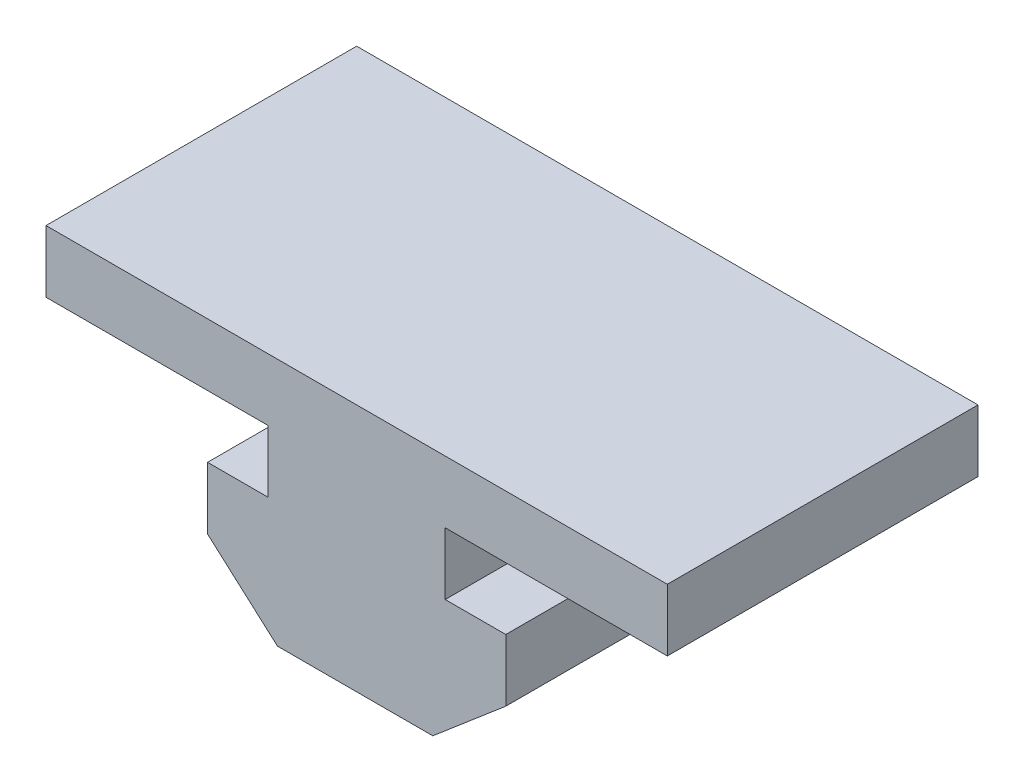
ISO-10303-21;
HEADER;
FILE_DESCRIPTION(('STEP AP214'),'2;1');
FILE_NAME('part.step','',(''),(''),'','','');
FILE_SCHEMA(('AUTOMOTIVE_DESIGN { 1 0 10303 214 1 1 1 1 }'));
ENDSEC;
DATA;
#1=APPLICATION_CONTEXT('core data for automotive mechanical design processes');
#2=APPLICATION_PROTOCOL_DEFINITION('international standard','automotive_design',2000,#1);
#3=PRODUCT_CONTEXT('',#1,'mechanical');
#4=PRODUCT('Part','Part','',(#3));
#5=PRODUCT_RELATED_PRODUCT_CATEGORY('part','',(#4));
#6=PRODUCT_DEFINITION_FORMATION('','',#4);
#7=PRODUCT_DEFINITION_CONTEXT('part definition',#1,'design');
#8=PRODUCT_DEFINITION('design','',#6,#7);
#9=PRODUCT_DEFINITION_SHAPE('','',#8);
#10=(LENGTH_UNIT() NAMED_UNIT(*) SI_UNIT(.MILLI.,.METRE.));
#11=(NAMED_UNIT(*) PLANE_ANGLE_UNIT() SI_UNIT($,.RADIAN.));
#12=(NAMED_UNIT(*) SI_UNIT($,.STERADIAN.) SOLID_ANGLE_UNIT());
#13=UNCERTAINTY_MEASURE_WITH_UNIT(LENGTH_MEASURE(1.E-05),#10,'distance_accuracy_value','');
#14=(GEOMETRIC_REPRESENTATION_CONTEXT(3) GLOBAL_UNCERTAINTY_ASSIGNED_CONTEXT((#13)) GLOBAL_UNIT_ASSIGNED_CONTEXT((#10,
#11,#12)) REPRESENTATION_CONTEXT('',''));
#15=CARTESIAN_POINT('',(0.,0.,0.));
#16=DIRECTION('',(0.,0.,1.));
#17=DIRECTION('',(1.,0.,0.));
#18=AXIS2_PLACEMENT_3D('',#15,#16,#17);
#19=CARTESIAN_POINT('',(-4.75,0.35,10.));
#20=DIRECTION('',(0.664363838829919,0.74740931868366,0.));
#21=DIRECTION('',(-0.74740931868366,0.66436383882992,0.));
#22=AXIS2_PLACEMENT_3D('',#19,#20,#21);
#23=PLANE('',#22);
#24=DIRECTION('',(0.74740931868366,-0.664363838829919,0.));
#25=VECTOR('',#24,1.);
#26=CARTESIAN_POINT('',(-4.75,0.35,0.));
#27=LINE('',#26,#25);
#28=CARTESIAN_POINT('',(-4.75,0.35,0.));
#29=VERTEX_POINT('',#28);
#30=CARTESIAN_POINT('',(-2.5,-1.65,0.));
#31=VERTEX_POINT('',#30);
#32=EDGE_CURVE('E180',#29,#31,#27,.T.);
#33=ORIENTED_EDGE('',*,*,#32,.T.);
#34=DIRECTION('',(0.,0.,-1.));
#35=VECTOR('',#34,1.);
#36=CARTESIAN_POINT('',(-2.5,-1.65,10.));
#37=LINE('',#36,#35);
#38=CARTESIAN_POINT('',(-2.5,-1.65,10.));
#39=VERTEX_POINT('',#38);
#40=EDGE_CURVE('E11',#39,#31,#37,.T.);
#41=ORIENTED_EDGE('',*,*,#40,.F.);
#42=DIRECTION('',(0.74740931868366,-0.664363838829919,0.));
#43=VECTOR('',#42,1.);
#44=CARTESIAN_POINT('',(-4.75,0.35,10.));
#45=LINE('',#44,#43);
#46=CARTESIAN_POINT('',(-4.75,0.35,10.));
#47=VERTEX_POINT('',#46);
#48=EDGE_CURVE('E220',#47,#39,#45,.T.);
#49=ORIENTED_EDGE('',*,*,#48,.F.);
#50=DIRECTION('',(0.,0.,-1.));
#51=VECTOR('',#50,1.);
#52=CARTESIAN_POINT('',(-4.75,0.35,10.));
#53=LINE('',#52,#51);
#54=EDGE_CURVE('E176',#47,#29,#53,.T.);
#55=ORIENTED_EDGE('',*,*,#54,.T.);
#56=EDGE_LOOP('',(#33,#41,#49,#55));
#57=FACE_BOUND('',#56,.T.);
#58=ADVANCED_FACE('F43',(#57),#23,.F.);
#59=CARTESIAN_POINT('',(-2.5,-1.65,10.));
#60=DIRECTION('',(0.,1.,0.));
#61=DIRECTION('',(0.,0.,1.));
#62=AXIS2_PLACEMENT_3D('',#59,#60,#61);
#63=PLANE('',#62);
#64=DIRECTION('',(1.,0.,0.));
#65=VECTOR('',#64,1.);
#66=CARTESIAN_POINT('',(-2.5,-1.65,0.));
#67=LINE('',#66,#65);
#68=CARTESIAN_POINT('',(2.5,-1.65,0.));
#69=VERTEX_POINT('',#68);
#70=EDGE_CURVE('E184',#31,#69,#67,.T.);
#71=ORIENTED_EDGE('',*,*,#70,.T.);
#72=DIRECTION('',(0.,0.,-1.));
#73=VECTOR('',#72,1.);
#74=CARTESIAN_POINT('',(2.5,-1.65,10.));
#75=LINE('',#74,#73);
#76=CARTESIAN_POINT('',(2.5,-1.65,10.));
#77=VERTEX_POINT('',#76);
#78=EDGE_CURVE('E52',#77,#69,#75,.T.);
#79=ORIENTED_EDGE('',*,*,#78,.F.);
#80=DIRECTION('',(1.,0.,0.));
#81=VECTOR('',#80,1.);
#82=CARTESIAN_POINT('',(-2.5,-1.65,10.));
#83=LINE('',#82,#81);
#84=EDGE_CURVE('E121',#39,#77,#83,.T.);
#85=ORIENTED_EDGE('',*,*,#84,.F.);
#86=ORIENTED_EDGE('',*,*,#40,.T.);
#87=EDGE_LOOP('',(#71,#79,#85,#86));
#88=FACE_BOUND('',#87,.T.);
#89=ADVANCED_FACE('F328',(#88),#63,.F.);
#90=CARTESIAN_POINT('',(4.85,0.350000000000002,10.));
#91=DIRECTION('',(-0.648118629528358,0.76153938969582,0.));
#92=DIRECTION('',(-0.761539389695821,-0.648118629528358,0.));
#93=AXIS2_PLACEMENT_3D('',#90,#91,#92);
#94=PLANE('',#93);
#95=DIRECTION('',(0.76153938969582,0.648118629528358,0.));
#96=VECTOR('',#95,1.);
#97=CARTESIAN_POINT('',(4.85,0.350000000000002,0.));
#98=LINE('',#97,#96);
#99=CARTESIAN_POINT('',(4.85,0.350000000000002,0.));
#100=VERTEX_POINT('',#99);
#101=EDGE_CURVE('E187',#69,#100,#98,.T.);
#102=ORIENTED_EDGE('',*,*,#101,.T.);
#103=DIRECTION('',(0.,0.,-1.));
#104=VECTOR('',#103,1.);
#105=CARTESIAN_POINT('',(4.85,0.350000000000002,10.));
#106=LINE('',#105,#104);
#107=CARTESIAN_POINT('',(4.85,0.350000000000002,10.));
#108=VERTEX_POINT('',#107);
#109=EDGE_CURVE('E255',#108,#100,#106,.T.);
#110=ORIENTED_EDGE('',*,*,#109,.F.);
#111=DIRECTION('',(0.76153938969582,0.648118629528358,0.));
#112=VECTOR('',#111,1.);
#113=CARTESIAN_POINT('',(4.85,0.350000000000002,10.));
#114=LINE('',#113,#112);
#115=EDGE_CURVE('E265',#77,#108,#114,.T.);
#116=ORIENTED_EDGE('',*,*,#115,.F.);
#117=ORIENTED_EDGE('',*,*,#78,.T.);
#118=EDGE_LOOP('',(#102,#110,#116,#117));
#119=FACE_BOUND('',#118,.T.);
#120=ADVANCED_FACE('F263',(#119),#94,.F.);
#121=CARTESIAN_POINT('',(4.85,2.35,10.));
#122=DIRECTION('',(-1.,0.,0.));
#123=DIRECTION('',(0.,-1.,0.));
#124=AXIS2_PLACEMENT_3D('',#121,#122,#123);
#125=PLANE('',#124);
#126=DIRECTION('',(0.,1.,0.));
#127=VECTOR('',#126,1.);
#128=CARTESIAN_POINT('',(4.85,2.35,0.));
#129=LINE('',#128,#127);
#130=CARTESIAN_POINT('',(4.85,2.35,0.));
#131=VERTEX_POINT('',#130);
#132=EDGE_CURVE('E190',#100,#131,#129,.T.);
#133=ORIENTED_EDGE('',*,*,#132,.T.);
#134=DIRECTION('',(0.,0.,-1.));
#135=VECTOR('',#134,1.);
#136=CARTESIAN_POINT('',(4.85,2.35,10.));
#137=LINE('',#136,#135);
#138=CARTESIAN_POINT('',(4.85,2.35,10.));
#139=VERTEX_POINT('',#138);
#140=EDGE_CURVE('E251',#139,#131,#137,.T.);
#141=ORIENTED_EDGE('',*,*,#140,.F.);
#142=DIRECTION('',(0.,1.,0.));
#143=VECTOR('',#142,1.);
#144=CARTESIAN_POINT('',(4.85,2.35,10.));
#145=LINE('',#144,#143);
#146=EDGE_CURVE('E284',#108,#139,#145,.T.);
#147=ORIENTED_EDGE('',*,*,#146,.F.);
#148=ORIENTED_EDGE('',*,*,#109,.T.);
#149=EDGE_LOOP('',(#133,#141,#147,#148));
#150=FACE_BOUND('',#149,.T.);
#151=ADVANCED_FACE('F274',(#150),#125,.F.);
#152=CARTESIAN_POINT('',(2.9,2.35,10.));
#153=DIRECTION('',(0.,-1.,0.));
#154=DIRECTION('',(0.,0.,-1.));
#155=AXIS2_PLACEMENT_3D('',#152,#153,#154);
#156=PLANE('',#155);
#157=DIRECTION('',(-1.,0.,0.));
#158=VECTOR('',#157,1.);
#159=CARTESIAN_POINT('',(2.9,2.35,0.));
#160=LINE('',#159,#158);
#161=CARTESIAN_POINT('',(2.9,2.35,0.));
#162=VERTEX_POINT('',#161);
#163=EDGE_CURVE('E193',#131,#162,#160,.T.);
#164=ORIENTED_EDGE('',*,*,#163,.T.);
#165=DIRECTION('',(0.,0.,-1.));
#166=VECTOR('',#165,1.);
#167=CARTESIAN_POINT('',(2.9,2.35,10.));
#168=LINE('',#167,#166);
#169=CARTESIAN_POINT('',(2.9,2.35,10.));
#170=VERTEX_POINT('',#169);
#171=EDGE_CURVE('E247',#170,#162,#168,.T.);
#172=ORIENTED_EDGE('',*,*,#171,.F.);
#173=DIRECTION('',(-1.,0.,0.));
#174=VECTOR('',#173,1.);
#175=CARTESIAN_POINT('',(2.9,2.35,10.));
#176=LINE('',#175,#174);
#177=EDGE_CURVE('E280',#139,#170,#176,.T.);
#178=ORIENTED_EDGE('',*,*,#177,.F.);
#179=ORIENTED_EDGE('',*,*,#140,.T.);
#180=EDGE_LOOP('',(#164,#172,#178,#179));
#181=FACE_BOUND('',#180,.T.);
#182=ADVANCED_FACE('F278',(#181),#156,.F.);
#183=CARTESIAN_POINT('',(2.9,2.35,10.));
#184=DIRECTION('',(-1.,0.,0.));
#185=DIRECTION('',(0.,-1.,0.));
#186=AXIS2_PLACEMENT_3D('',#183,#184,#185);
#187=PLANE('',#186);
#188=DIRECTION('',(0.,1.,0.));
#189=VECTOR('',#188,1.);
#190=CARTESIAN_POINT('',(2.9,2.35,0.));
#191=LINE('',#190,#189);
#192=CARTESIAN_POINT('',(2.9,4.35,0.));
#193=VERTEX_POINT('',#192);
#194=EDGE_CURVE('E196',#162,#193,#191,.T.);
#195=ORIENTED_EDGE('',*,*,#194,.T.);
#196=DIRECTION('',(0.,0.,-1.));
#197=VECTOR('',#196,1.);
#198=CARTESIAN_POINT('',(2.9,4.35,10.));
#199=LINE('',#198,#197);
#200=CARTESIAN_POINT('',(2.9,4.35,10.));
#201=VERTEX_POINT('',#200);
#202=EDGE_CURVE('E243',#201,#193,#199,.T.);
#203=ORIENTED_EDGE('',*,*,#202,.F.);
#204=DIRECTION('',(0.,1.,0.));
#205=VECTOR('',#204,1.);
#206=CARTESIAN_POINT('',(2.9,2.35,10.));
#207=LINE('',#206,#205);
#208=EDGE_CURVE('E283',#170,#201,#207,.T.);
#209=ORIENTED_EDGE('',*,*,#208,.F.);
#210=ORIENTED_EDGE('',*,*,#171,.T.);
#211=EDGE_LOOP('',(#195,#203,#209,#210));
#212=FACE_BOUND('',#211,.T.);
#213=ADVANCED_FACE('F341',(#212),#187,.F.);
#214=CARTESIAN_POINT('',(2.9,4.35,10.));
#215=DIRECTION('',(0.,1.,0.));
#216=DIRECTION('',(0.,0.,1.));
#217=AXIS2_PLACEMENT_3D('',#214,#215,#216);
#218=PLANE('',#217);
#219=DIRECTION('',(1.,0.,0.));
#220=VECTOR('',#219,1.);
#221=CARTESIAN_POINT('',(2.9,4.35,0.));
#222=LINE('',#221,#220);
#223=CARTESIAN_POINT('',(10.05,4.35,0.));
#224=VERTEX_POINT('',#223);
#225=EDGE_CURVE('E199',#193,#224,#222,.T.);
#226=ORIENTED_EDGE('',*,*,#225,.T.);
#227=DIRECTION('',(0.,0.,-1.));
#228=VECTOR('',#227,1.);
#229=CARTESIAN_POINT('',(10.05,4.35,10.));
#230=LINE('',#229,#228);
#231=CARTESIAN_POINT('',(10.05,4.35,10.));
#232=VERTEX_POINT('',#231);
#233=EDGE_CURVE('E239',#232,#224,#230,.T.);
#234=ORIENTED_EDGE('',*,*,#233,.F.);
#235=DIRECTION('',(1.,0.,0.));
#236=VECTOR('',#235,1.);
#237=CARTESIAN_POINT('',(2.9,4.35,10.));
#238=LINE('',#237,#236);
#239=EDGE_CURVE('E288',#201,#232,#238,.T.);
#240=ORIENTED_EDGE('',*,*,#239,.F.);
#241=ORIENTED_EDGE('',*,*,#202,.T.);
#242=EDGE_LOOP('',(#226,#234,#240,#241));
#243=FACE_BOUND('',#242,.T.);
#244=ADVANCED_FACE('F344',(#243),#218,.F.);
#245=CARTESIAN_POINT('',(10.05,4.35,10.));
#246=DIRECTION('',(-1.,0.,0.));
#247=DIRECTION('',(0.,0.,1.));
#248=AXIS2_PLACEMENT_3D('',#245,#246,#247);
#249=PLANE('',#248);
#250=DIRECTION('',(0.,1.,0.));
#251=VECTOR('',#250,1.);
#252=CARTESIAN_POINT('',(10.05,4.35,0.));
#253=LINE('',#252,#251);
#254=CARTESIAN_POINT('',(10.05,6.35,0.));
#255=VERTEX_POINT('',#254);
#256=EDGE_CURVE('E202',#224,#255,#253,.T.);
#257=ORIENTED_EDGE('',*,*,#256,.T.);
#258=DIRECTION('',(0.,0.,-1.));
#259=VECTOR('',#258,1.);
#260=CARTESIAN_POINT('',(10.05,6.35,10.));
#261=LINE('',#260,#259);
#262=CARTESIAN_POINT('',(10.05,6.35,10.));
#263=VERTEX_POINT('',#262);
#264=EDGE_CURVE('E235',#263,#255,#261,.T.);
#265=ORIENTED_EDGE('',*,*,#264,.F.);
#266=DIRECTION('',(0.,1.,0.));
#267=VECTOR('',#266,1.);
#268=CARTESIAN_POINT('',(10.05,4.35,10.));
#269=LINE('',#268,#267);
#270=EDGE_CURVE('E295',#232,#263,#269,.T.);
#271=ORIENTED_EDGE('',*,*,#270,.F.);
#272=ORIENTED_EDGE('',*,*,#233,.T.);
#273=EDGE_LOOP('',(#257,#265,#271,#272));
#274=FACE_BOUND('',#273,.T.);
#275=ADVANCED_FACE('F348',(#274),#249,.F.);
#276=CARTESIAN_POINT('',(-9.95,6.35,10.));
#277=DIRECTION('',(0.,-1.,0.));
#278=DIRECTION('',(1.,0.,0.));
#279=AXIS2_PLACEMENT_3D('',#276,#277,#278);
#280=PLANE('',#279);
#281=DIRECTION('',(-1.,0.,0.));
#282=VECTOR('',#281,1.);
#283=CARTESIAN_POINT('',(-9.95,6.35,0.));
#284=LINE('',#283,#282);
#285=CARTESIAN_POINT('',(-9.95,6.35,0.));
#286=VERTEX_POINT('',#285);
#287=EDGE_CURVE('E205',#255,#286,#284,.T.);
#288=ORIENTED_EDGE('',*,*,#287,.T.);
#289=DIRECTION('',(0.,0.,-1.));
#290=VECTOR('',#289,1.);
#291=CARTESIAN_POINT('',(-9.95,6.35,10.));
#292=LINE('',#291,#290);
#293=CARTESIAN_POINT('',(-9.95,6.35,10.));
#294=VERTEX_POINT('',#293);
#295=EDGE_CURVE('E231',#294,#286,#292,.T.);
#296=ORIENTED_EDGE('',*,*,#295,.F.);
#297=DIRECTION('',(-1.,0.,0.));
#298=VECTOR('',#297,1.);
#299=CARTESIAN_POINT('',(-9.95,6.35,10.));
#300=LINE('',#299,#298);
#301=EDGE_CURVE('E298',#263,#294,#300,.T.);
#302=ORIENTED_EDGE('',*,*,#301,.F.);
#303=ORIENTED_EDGE('',*,*,#264,.T.);
#304=EDGE_LOOP('',(#288,#296,#302,#303));
#305=FACE_BOUND('',#304,.T.);
#306=ADVANCED_FACE('F352',(#305),#280,.F.);
#307=CARTESIAN_POINT('',(-9.95,4.35,10.));
#308=DIRECTION('',(1.,0.,0.));
#309=DIRECTION('',(0.,0.,-1.));
#310=AXIS2_PLACEMENT_3D('',#307,#308,#309);
#311=PLANE('',#310);
#312=DIRECTION('',(0.,-1.,0.));
#313=VECTOR('',#312,1.);
#314=CARTESIAN_POINT('',(-9.95,4.35,0.));
#315=LINE('',#314,#313);
#316=CARTESIAN_POINT('',(-9.95,4.35,0.));
#317=VERTEX_POINT('',#316);
#318=EDGE_CURVE('E208',#286,#317,#315,.T.);
#319=ORIENTED_EDGE('',*,*,#318,.T.);
#320=DIRECTION('',(0.,0.,-1.));
#321=VECTOR('',#320,1.);
#322=CARTESIAN_POINT('',(-9.95,4.35,10.));
#323=LINE('',#322,#321);
#324=CARTESIAN_POINT('',(-9.95,4.35,10.));
#325=VERTEX_POINT('',#324);
#326=EDGE_CURVE('E227',#325,#317,#323,.T.);
#327=ORIENTED_EDGE('',*,*,#326,.F.);
#328=DIRECTION('',(0.,-1.,0.));
#329=VECTOR('',#328,1.);
#330=CARTESIAN_POINT('',(-9.95,4.35,10.));
#331=LINE('',#330,#329);
#332=EDGE_CURVE('E301',#294,#325,#331,.T.);
#333=ORIENTED_EDGE('',*,*,#332,.F.);
#334=ORIENTED_EDGE('',*,*,#295,.T.);
#335=EDGE_LOOP('',(#319,#327,#333,#334));
#336=FACE_BOUND('',#335,.T.);
#337=ADVANCED_FACE('F309',(#336),#311,.F.);
#338=CARTESIAN_POINT('',(-2.8,4.35,10.));
#339=DIRECTION('',(0.,1.,0.));
#340=DIRECTION('',(-1.,0.,0.));
#341=AXIS2_PLACEMENT_3D('',#338,#339,#340);
#342=PLANE('',#341);
#343=DIRECTION('',(1.,0.,0.));
#344=VECTOR('',#343,1.);
#345=CARTESIAN_POINT('',(-2.8,4.35,0.));
#346=LINE('',#345,#344);
#347=CARTESIAN_POINT('',(-2.8,4.35,0.));
#348=VERTEX_POINT('',#347);
#349=EDGE_CURVE('E211',#317,#348,#346,.T.);
#350=ORIENTED_EDGE('',*,*,#349,.T.);
#351=DIRECTION('',(0.,0.,-1.));
#352=VECTOR('',#351,1.);
#353=CARTESIAN_POINT('',(-2.8,4.35,10.));
#354=LINE('',#353,#352);
#355=CARTESIAN_POINT('',(-2.8,4.35,10.));
#356=VERTEX_POINT('',#355);
#357=EDGE_CURVE('E169',#356,#348,#354,.T.);
#358=ORIENTED_EDGE('',*,*,#357,.F.);
#359=DIRECTION('',(1.,0.,0.));
#360=VECTOR('',#359,1.);
#361=CARTESIAN_POINT('',(-2.8,4.35,10.));
#362=LINE('',#361,#360);
#363=EDGE_CURVE('E158',#325,#356,#362,.T.);
#364=ORIENTED_EDGE('',*,*,#363,.F.);
#365=ORIENTED_EDGE('',*,*,#326,.T.);
#366=EDGE_LOOP('',(#350,#358,#364,#365));
#367=FACE_BOUND('',#366,.T.);
#368=ADVANCED_FACE('F313',(#367),#342,.F.);
#369=CARTESIAN_POINT('',(-2.8,2.35,10.));
#370=DIRECTION('',(1.,0.,0.));
#371=DIRECTION('',(0.,0.,-1.));
#372=AXIS2_PLACEMENT_3D('',#369,#370,#371);
#373=PLANE('',#372);
#374=DIRECTION('',(0.,-1.,0.));
#375=VECTOR('',#374,1.);
#376=CARTESIAN_POINT('',(-2.8,2.35,0.));
#377=LINE('',#376,#375);
#378=CARTESIAN_POINT('',(-2.8,2.35,0.));
#379=VERTEX_POINT('',#378);
#380=EDGE_CURVE('E167',#348,#379,#377,.T.);
#381=ORIENTED_EDGE('',*,*,#380,.T.);
#382=DIRECTION('',(0.,0.,-1.));
#383=VECTOR('',#382,1.);
#384=CARTESIAN_POINT('',(-2.8,2.35,10.));
#385=LINE('',#384,#383);
#386=CARTESIAN_POINT('',(-2.8,2.35,10.));
#387=VERTEX_POINT('',#386);
#388=EDGE_CURVE('E164',#387,#379,#385,.T.);
#389=ORIENTED_EDGE('',*,*,#388,.F.);
#390=DIRECTION('',(0.,-1.,0.));
#391=VECTOR('',#390,1.);
#392=CARTESIAN_POINT('',(-2.8,2.35,10.));
#393=LINE('',#392,#391);
#394=EDGE_CURVE('E152',#356,#387,#393,.T.);
#395=ORIENTED_EDGE('',*,*,#394,.F.);
#396=ORIENTED_EDGE('',*,*,#357,.T.);
#397=EDGE_LOOP('',(#381,#389,#395,#396));
#398=FACE_BOUND('',#397,.T.);
#399=ADVANCED_FACE('F165',(#398),#373,.F.);
#400=CARTESIAN_POINT('',(-4.75,2.35,10.));
#401=DIRECTION('',(0.,-1.,0.));
#402=DIRECTION('',(0.,0.,-1.));
#403=AXIS2_PLACEMENT_3D('',#400,#401,#402);
#404=PLANE('',#403);
#405=DIRECTION('',(-1.,0.,0.));
#406=VECTOR('',#405,1.);
#407=CARTESIAN_POINT('',(-4.75,2.35,0.));
#408=LINE('',#407,#406);
#409=CARTESIAN_POINT('',(-4.75,2.35,0.));
#410=VERTEX_POINT('',#409);
#411=EDGE_CURVE('E107',#379,#410,#408,.T.);
#412=ORIENTED_EDGE('',*,*,#411,.T.);
#413=DIRECTION('',(0.,0.,-1.));
#414=VECTOR('',#413,1.);
#415=CARTESIAN_POINT('',(-4.75,2.35,10.));
#416=LINE('',#415,#414);
#417=CARTESIAN_POINT('',(-4.75,2.35,10.));
#418=VERTEX_POINT('',#417);
#419=EDGE_CURVE('E170',#418,#410,#416,.T.);
#420=ORIENTED_EDGE('',*,*,#419,.F.);
#421=DIRECTION('',(-1.,0.,0.));
#422=VECTOR('',#421,1.);
#423=CARTESIAN_POINT('',(-4.75,2.35,10.));
#424=LINE('',#423,#422);
#425=EDGE_CURVE('E156',#387,#418,#424,.T.);
#426=ORIENTED_EDGE('',*,*,#425,.F.);
#427=ORIENTED_EDGE('',*,*,#388,.T.);
#428=EDGE_LOOP('',(#412,#420,#426,#427));
#429=FACE_BOUND('',#428,.T.);
#430=ADVANCED_FACE('F172',(#429),#404,.F.);
#431=CARTESIAN_POINT('',(-4.75,2.35,10.));
#432=DIRECTION('',(1.,0.,0.));
#433=DIRECTION('',(0.,0.,-1.));
#434=AXIS2_PLACEMENT_3D('',#431,#432,#433);
#435=PLANE('',#434);
#436=DIRECTION('',(0.,-1.,0.));
#437=VECTOR('',#436,1.);
#438=CARTESIAN_POINT('',(-4.75,2.35,0.));
#439=LINE('',#438,#437);
#440=EDGE_CURVE('E113',#410,#29,#439,.T.);
#441=ORIENTED_EDGE('',*,*,#440,.T.);
#442=ORIENTED_EDGE('',*,*,#54,.F.);
#443=DIRECTION('',(0.,-1.,0.));
#444=VECTOR('',#443,1.);
#445=CARTESIAN_POINT('',(-4.75,2.35,10.));
#446=LINE('',#445,#444);
#447=EDGE_CURVE('E60',#418,#47,#446,.T.);
#448=ORIENTED_EDGE('',*,*,#447,.F.);
#449=ORIENTED_EDGE('',*,*,#419,.T.);
#450=EDGE_LOOP('',(#441,#442,#448,#449));
#451=FACE_BOUND('',#450,.T.);
#452=ADVANCED_FACE('F317',(#451),#435,.F.);
#453=CARTESIAN_POINT('',(0.,0.,10.));
#454=DIRECTION('',(0.,0.,-1.));
#455=DIRECTION('',(-1.,0.,0.));
#456=AXIS2_PLACEMENT_3D('',#453,#454,#455);
#457=PLANE('',#456);
#458=ORIENTED_EDGE('',*,*,#48,.T.);
#459=ORIENTED_EDGE('',*,*,#84,.T.);
#460=ORIENTED_EDGE('',*,*,#115,.T.);
#461=ORIENTED_EDGE('',*,*,#146,.T.);
#462=ORIENTED_EDGE('',*,*,#177,.T.);
#463=ORIENTED_EDGE('',*,*,#208,.T.);
#464=ORIENTED_EDGE('',*,*,#239,.T.);
#465=ORIENTED_EDGE('',*,*,#270,.T.);
#466=ORIENTED_EDGE('',*,*,#301,.T.);
#467=ORIENTED_EDGE('',*,*,#332,.T.);
#468=ORIENTED_EDGE('',*,*,#363,.T.);
#469=ORIENTED_EDGE('',*,*,#394,.T.);
#470=ORIENTED_EDGE('',*,*,#425,.T.);
#471=ORIENTED_EDGE('',*,*,#447,.T.);
#472=EDGE_LOOP('',(#458,#459,#460,#461,#462,#463,#464,#465,#466,#467,#468,#469,#470,#471));
#473=FACE_BOUND('',#472,.T.);
#474=ADVANCED_FACE('F154',(#473),#457,.F.);
#475=CARTESIAN_POINT('',(0.,0.,0.));
#476=DIRECTION('',(0.,0.,-1.));
#477=DIRECTION('',(-1.,0.,0.));
#478=AXIS2_PLACEMENT_3D('',#475,#476,#477);
#479=PLANE('',#478);
#480=ORIENTED_EDGE('',*,*,#32,.F.);
#481=ORIENTED_EDGE('',*,*,#440,.F.);
#482=ORIENTED_EDGE('',*,*,#411,.F.);
#483=ORIENTED_EDGE('',*,*,#380,.F.);
#484=ORIENTED_EDGE('',*,*,#349,.F.);
#485=ORIENTED_EDGE('',*,*,#318,.F.);
#486=ORIENTED_EDGE('',*,*,#287,.F.);
#487=ORIENTED_EDGE('',*,*,#256,.F.);
#488=ORIENTED_EDGE('',*,*,#225,.F.);
#489=ORIENTED_EDGE('',*,*,#194,.F.);
#490=ORIENTED_EDGE('',*,*,#163,.F.);
#491=ORIENTED_EDGE('',*,*,#132,.F.);
#492=ORIENTED_EDGE('',*,*,#101,.F.);
#493=ORIENTED_EDGE('',*,*,#70,.F.);
#494=EDGE_LOOP('',(#480,#481,#482,#483,#484,#485,#486,#487,#488,#489,#490,#491,#492,#493));
#495=FACE_BOUND('',#494,.T.);
#496=ADVANCED_FACE('F269',(#495),#479,.T.);
#497=CLOSED_SHELL('',(#58,#89,#120,#151,#182,#213,#244,#275,#306,#337,#368,#399,#430,#452,#474,#496));
#498=MANIFOLD_SOLID_BREP('B2',#497);
#499=ADVANCED_BREP_SHAPE_REPRESENTATION('',(#18,#498),#14);
#500=SHAPE_DEFINITION_REPRESENTATION(#9,#499);
ENDSEC;
END-ISO-10303-21;
